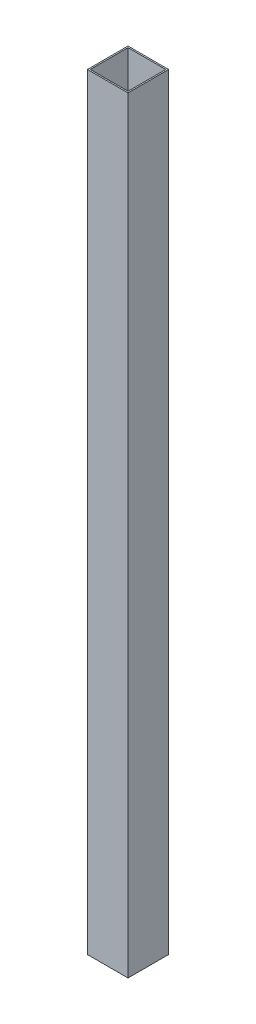
ISO-10303-21;
HEADER;
FILE_DESCRIPTION(('STEP AP214'),'2;1');
FILE_NAME('part.step','',(''),(''),'','','');
FILE_SCHEMA(('AUTOMOTIVE_DESIGN { 1 0 10303 214 1 1 1 1 }'));
ENDSEC;
DATA;
#1=APPLICATION_CONTEXT('core data for automotive mechanical design processes');
#2=APPLICATION_PROTOCOL_DEFINITION('international standard','automotive_design',2000,#1);
#3=PRODUCT_CONTEXT('',#1,'mechanical');
#4=PRODUCT('Part','Part','',(#3));
#5=PRODUCT_RELATED_PRODUCT_CATEGORY('part','',(#4));
#6=PRODUCT_DEFINITION_FORMATION('','',#4);
#7=PRODUCT_DEFINITION_CONTEXT('part definition',#1,'design');
#8=PRODUCT_DEFINITION('design','',#6,#7);
#9=PRODUCT_DEFINITION_SHAPE('','',#8);
#10=(LENGTH_UNIT() NAMED_UNIT(*) SI_UNIT(.MILLI.,.METRE.));
#11=(NAMED_UNIT(*) PLANE_ANGLE_UNIT() SI_UNIT($,.RADIAN.));
#12=(NAMED_UNIT(*) SI_UNIT($,.STERADIAN.) SOLID_ANGLE_UNIT());
#13=UNCERTAINTY_MEASURE_WITH_UNIT(LENGTH_MEASURE(1.E-05),#10,'distance_accuracy_value','');
#14=(GEOMETRIC_REPRESENTATION_CONTEXT(3) GLOBAL_UNCERTAINTY_ASSIGNED_CONTEXT((#13)) GLOBAL_UNIT_ASSIGNED_CONTEXT((#10,
#11,#12)) REPRESENTATION_CONTEXT('',''));
#15=CARTESIAN_POINT('',(0.,0.,0.));
#16=DIRECTION('',(0.,0.,1.));
#17=DIRECTION('',(1.,0.,0.));
#18=AXIS2_PLACEMENT_3D('',#15,#16,#17);
#19=CARTESIAN_POINT('',(0.,479.425,0.));
#20=DIRECTION('',(0.,1.,0.));
#21=DIRECTION('',(0.,0.,1.));
#22=AXIS2_PLACEMENT_3D('',#19,#20,#21);
#23=PLANE('',#22);
#24=DIRECTION('',(0.,0.,-1.));
#25=VECTOR('',#24,1.);
#26=CARTESIAN_POINT('',(12.7,479.425,-12.7));
#27=LINE('',#26,#25);
#28=CARTESIAN_POINT('',(12.7,479.425,12.7));
#29=VERTEX_POINT('',#28);
#30=CARTESIAN_POINT('',(12.7,479.425,-12.7));
#31=VERTEX_POINT('',#30);
#32=EDGE_CURVE('E136',#29,#31,#27,.T.);
#33=ORIENTED_EDGE('',*,*,#32,.T.);
#34=DIRECTION('',(-1.,0.,0.));
#35=VECTOR('',#34,1.);
#36=CARTESIAN_POINT('',(-12.7,479.425,-12.7));
#37=LINE('',#36,#35);
#38=CARTESIAN_POINT('',(-12.7,479.425,-12.7));
#39=VERTEX_POINT('',#38);
#40=EDGE_CURVE('E139',#31,#39,#37,.T.);
#41=ORIENTED_EDGE('',*,*,#40,.T.);
#42=DIRECTION('',(0.,0.,1.));
#43=VECTOR('',#42,1.);
#44=CARTESIAN_POINT('',(-12.7,479.425,-12.7));
#45=LINE('',#44,#43);
#46=CARTESIAN_POINT('',(-12.7,479.425,12.7));
#47=VERTEX_POINT('',#46);
#48=EDGE_CURVE('E142',#39,#47,#45,.T.);
#49=ORIENTED_EDGE('',*,*,#48,.T.);
#50=DIRECTION('',(1.,0.,0.));
#51=VECTOR('',#50,1.);
#52=CARTESIAN_POINT('',(-12.7,479.425,12.7));
#53=LINE('',#52,#51);
#54=EDGE_CURVE('E144',#47,#29,#53,.T.);
#55=ORIENTED_EDGE('',*,*,#54,.T.);
#56=EDGE_LOOP('',(#33,#41,#49,#55));
#57=FACE_BOUND('',#56,.T.);
#58=DIRECTION('',(1.,0.,0.));
#59=VECTOR('',#58,1.);
#60=CARTESIAN_POINT('',(-11.811,479.425,11.811));
#61=LINE('',#60,#59);
#62=CARTESIAN_POINT('',(-11.811,479.425,11.811));
#63=VERTEX_POINT('',#62);
#64=CARTESIAN_POINT('',(11.811,479.425,11.811));
#65=VERTEX_POINT('',#64);
#66=EDGE_CURVE('E108',#63,#65,#61,.T.);
#67=ORIENTED_EDGE('',*,*,#66,.F.);
#68=DIRECTION('',(0.,0.,1.));
#69=VECTOR('',#68,1.);
#70=CARTESIAN_POINT('',(-11.811,479.425,-11.811));
#71=LINE('',#70,#69);
#72=CARTESIAN_POINT('',(-11.811,479.425,-11.811));
#73=VERTEX_POINT('',#72);
#74=EDGE_CURVE('E100',#73,#63,#71,.T.);
#75=ORIENTED_EDGE('',*,*,#74,.F.);
#76=DIRECTION('',(-1.,0.,0.));
#77=VECTOR('',#76,1.);
#78=CARTESIAN_POINT('',(-11.811,479.425,-11.811));
#79=LINE('',#78,#77);
#80=CARTESIAN_POINT('',(11.811,479.425,-11.811));
#81=VERTEX_POINT('',#80);
#82=EDGE_CURVE('E122',#81,#73,#79,.T.);
#83=ORIENTED_EDGE('',*,*,#82,.F.);
#84=DIRECTION('',(0.,0.,-1.));
#85=VECTOR('',#84,1.);
#86=CARTESIAN_POINT('',(11.811,479.425,-11.811));
#87=LINE('',#86,#85);
#88=EDGE_CURVE('E120',#65,#81,#87,.T.);
#89=ORIENTED_EDGE('',*,*,#88,.F.);
#90=EDGE_LOOP('',(#67,#75,#83,#89));
#91=FACE_BOUND('',#90,.T.);
#92=ADVANCED_FACE('F35',(#57,#91),#23,.T.);
#93=CARTESIAN_POINT('',(0.,0.,0.));
#94=DIRECTION('',(0.,1.,0.));
#95=DIRECTION('',(0.,0.,1.));
#96=AXIS2_PLACEMENT_3D('',#93,#94,#95);
#97=PLANE('',#96);
#98=DIRECTION('',(0.,0.,-1.));
#99=VECTOR('',#98,1.);
#100=CARTESIAN_POINT('',(12.7,0.,-12.7));
#101=LINE('',#100,#99);
#102=CARTESIAN_POINT('',(12.7,0.,12.7));
#103=VERTEX_POINT('',#102);
#104=CARTESIAN_POINT('',(12.7,0.,-12.7));
#105=VERTEX_POINT('',#104);
#106=EDGE_CURVE('E116',#103,#105,#101,.T.);
#107=ORIENTED_EDGE('',*,*,#106,.F.);
#108=DIRECTION('',(1.,0.,0.));
#109=VECTOR('',#108,1.);
#110=CARTESIAN_POINT('',(-12.7,0.,12.7));
#111=LINE('',#110,#109);
#112=CARTESIAN_POINT('',(-12.7,0.,12.7));
#113=VERTEX_POINT('',#112);
#114=EDGE_CURVE('E140',#113,#103,#111,.T.);
#115=ORIENTED_EDGE('',*,*,#114,.F.);
#116=DIRECTION('',(0.,0.,1.));
#117=VECTOR('',#116,1.);
#118=CARTESIAN_POINT('',(-12.7,0.,-12.7));
#119=LINE('',#118,#117);
#120=CARTESIAN_POINT('',(-12.7,0.,-12.7));
#121=VERTEX_POINT('',#120);
#122=EDGE_CURVE('E151',#121,#113,#119,.T.);
#123=ORIENTED_EDGE('',*,*,#122,.F.);
#124=DIRECTION('',(-1.,0.,0.));
#125=VECTOR('',#124,1.);
#126=CARTESIAN_POINT('',(-12.7,0.,-12.7));
#127=LINE('',#126,#125);
#128=EDGE_CURVE('E149',#105,#121,#127,.T.);
#129=ORIENTED_EDGE('',*,*,#128,.F.);
#130=EDGE_LOOP('',(#107,#115,#123,#129));
#131=FACE_BOUND('',#130,.T.);
#132=DIRECTION('',(0.,0.,1.));
#133=VECTOR('',#132,1.);
#134=CARTESIAN_POINT('',(-11.811,0.,-11.811));
#135=LINE('',#134,#133);
#136=CARTESIAN_POINT('',(-11.811,0.,-11.811));
#137=VERTEX_POINT('',#136);
#138=CARTESIAN_POINT('',(-11.811,0.,11.811));
#139=VERTEX_POINT('',#138);
#140=EDGE_CURVE('E58',#137,#139,#135,.T.);
#141=ORIENTED_EDGE('',*,*,#140,.T.);
#142=DIRECTION('',(1.,0.,0.));
#143=VECTOR('',#142,1.);
#144=CARTESIAN_POINT('',(-11.811,0.,11.811));
#145=LINE('',#144,#143);
#146=CARTESIAN_POINT('',(11.811,0.,11.811));
#147=VERTEX_POINT('',#146);
#148=EDGE_CURVE('E115',#139,#147,#145,.T.);
#149=ORIENTED_EDGE('',*,*,#148,.T.);
#150=DIRECTION('',(0.,0.,-1.));
#151=VECTOR('',#150,1.);
#152=CARTESIAN_POINT('',(11.811,0.,-11.811));
#153=LINE('',#152,#151);
#154=CARTESIAN_POINT('',(11.811,0.,-11.811));
#155=VERTEX_POINT('',#154);
#156=EDGE_CURVE('E128',#147,#155,#153,.T.);
#157=ORIENTED_EDGE('',*,*,#156,.T.);
#158=DIRECTION('',(-1.,0.,0.));
#159=VECTOR('',#158,1.);
#160=CARTESIAN_POINT('',(-11.811,0.,-11.811));
#161=LINE('',#160,#159);
#162=EDGE_CURVE('E109',#155,#137,#161,.T.);
#163=ORIENTED_EDGE('',*,*,#162,.T.);
#164=EDGE_LOOP('',(#141,#149,#157,#163));
#165=FACE_BOUND('',#164,.T.);
#166=ADVANCED_FACE('F169',(#131,#165),#97,.F.);
#167=CARTESIAN_POINT('',(12.7,479.425,-12.7));
#168=DIRECTION('',(-1.,0.,0.));
#169=DIRECTION('',(0.,0.,1.));
#170=AXIS2_PLACEMENT_3D('',#167,#168,#169);
#171=PLANE('',#170);
#172=ORIENTED_EDGE('',*,*,#106,.T.);
#173=DIRECTION('',(0.,-1.,0.));
#174=VECTOR('',#173,1.);
#175=CARTESIAN_POINT('',(12.7,479.425,-12.7));
#176=LINE('',#175,#174);
#177=EDGE_CURVE('E11',#31,#105,#176,.T.);
#178=ORIENTED_EDGE('',*,*,#177,.F.);
#179=ORIENTED_EDGE('',*,*,#32,.F.);
#180=DIRECTION('',(0.,-1.,0.));
#181=VECTOR('',#180,1.);
#182=CARTESIAN_POINT('',(12.7,479.425,12.7));
#183=LINE('',#182,#181);
#184=EDGE_CURVE('E146',#29,#103,#183,.T.);
#185=ORIENTED_EDGE('',*,*,#184,.T.);
#186=EDGE_LOOP('',(#172,#178,#179,#185));
#187=FACE_BOUND('',#186,.T.);
#188=ADVANCED_FACE('F37',(#187),#171,.F.);
#189=CARTESIAN_POINT('',(-12.7,479.425,-12.7));
#190=DIRECTION('',(0.,0.,1.));
#191=DIRECTION('',(1.,0.,0.));
#192=AXIS2_PLACEMENT_3D('',#189,#190,#191);
#193=PLANE('',#192);
#194=ORIENTED_EDGE('',*,*,#128,.T.);
#195=DIRECTION('',(0.,-1.,0.));
#196=VECTOR('',#195,1.);
#197=CARTESIAN_POINT('',(-12.7,479.425,-12.7));
#198=LINE('',#197,#196);
#199=EDGE_CURVE('E43',#39,#121,#198,.T.);
#200=ORIENTED_EDGE('',*,*,#199,.F.);
#201=ORIENTED_EDGE('',*,*,#40,.F.);
#202=ORIENTED_EDGE('',*,*,#177,.T.);
#203=EDGE_LOOP('',(#194,#200,#201,#202));
#204=FACE_BOUND('',#203,.T.);
#205=ADVANCED_FACE('F179',(#204),#193,.F.);
#206=CARTESIAN_POINT('',(-12.7,479.425,-12.7));
#207=DIRECTION('',(1.,0.,0.));
#208=DIRECTION('',(0.,0.,-1.));
#209=AXIS2_PLACEMENT_3D('',#206,#207,#208);
#210=PLANE('',#209);
#211=ORIENTED_EDGE('',*,*,#122,.T.);
#212=DIRECTION('',(0.,-1.,0.));
#213=VECTOR('',#212,1.);
#214=CARTESIAN_POINT('',(-12.7,479.425,12.7));
#215=LINE('',#214,#213);
#216=EDGE_CURVE('E156',#47,#113,#215,.T.);
#217=ORIENTED_EDGE('',*,*,#216,.F.);
#218=ORIENTED_EDGE('',*,*,#48,.F.);
#219=ORIENTED_EDGE('',*,*,#199,.T.);
#220=EDGE_LOOP('',(#211,#217,#218,#219));
#221=FACE_BOUND('',#220,.T.);
#222=ADVANCED_FACE('F163',(#221),#210,.F.);
#223=CARTESIAN_POINT('',(-12.7,479.425,12.7));
#224=DIRECTION('',(0.,0.,-1.));
#225=DIRECTION('',(-1.,0.,0.));
#226=AXIS2_PLACEMENT_3D('',#223,#224,#225);
#227=PLANE('',#226);
#228=ORIENTED_EDGE('',*,*,#114,.T.);
#229=ORIENTED_EDGE('',*,*,#184,.F.);
#230=ORIENTED_EDGE('',*,*,#54,.F.);
#231=ORIENTED_EDGE('',*,*,#216,.T.);
#232=EDGE_LOOP('',(#228,#229,#230,#231));
#233=FACE_BOUND('',#232,.T.);
#234=ADVANCED_FACE('F173',(#233),#227,.F.);
#235=CARTESIAN_POINT('',(-11.811,479.425,-11.811));
#236=DIRECTION('',(1.,0.,0.));
#237=DIRECTION('',(0.,0.,-1.));
#238=AXIS2_PLACEMENT_3D('',#235,#236,#237);
#239=PLANE('',#238);
#240=ORIENTED_EDGE('',*,*,#140,.F.);
#241=DIRECTION('',(0.,-1.,0.));
#242=VECTOR('',#241,1.);
#243=CARTESIAN_POINT('',(-11.811,479.425,-11.811));
#244=LINE('',#243,#242);
#245=EDGE_CURVE('E104',#73,#137,#244,.T.);
#246=ORIENTED_EDGE('',*,*,#245,.F.);
#247=ORIENTED_EDGE('',*,*,#74,.T.);
#248=DIRECTION('',(0.,-1.,0.));
#249=VECTOR('',#248,1.);
#250=CARTESIAN_POINT('',(-11.811,479.425,11.811));
#251=LINE('',#250,#249);
#252=EDGE_CURVE('E103',#63,#139,#251,.T.);
#253=ORIENTED_EDGE('',*,*,#252,.T.);
#254=EDGE_LOOP('',(#240,#246,#247,#253));
#255=FACE_BOUND('',#254,.T.);
#256=ADVANCED_FACE('F102',(#255),#239,.T.);
#257=CARTESIAN_POINT('',(-11.811,479.425,11.811));
#258=DIRECTION('',(0.,0.,-1.));
#259=DIRECTION('',(-1.,0.,0.));
#260=AXIS2_PLACEMENT_3D('',#257,#258,#259);
#261=PLANE('',#260);
#262=ORIENTED_EDGE('',*,*,#148,.F.);
#263=ORIENTED_EDGE('',*,*,#252,.F.);
#264=ORIENTED_EDGE('',*,*,#66,.T.);
#265=DIRECTION('',(0.,-1.,0.));
#266=VECTOR('',#265,1.);
#267=CARTESIAN_POINT('',(11.811,479.425,11.811));
#268=LINE('',#267,#266);
#269=EDGE_CURVE('E117',#65,#147,#268,.T.);
#270=ORIENTED_EDGE('',*,*,#269,.T.);
#271=EDGE_LOOP('',(#262,#263,#264,#270));
#272=FACE_BOUND('',#271,.T.);
#273=ADVANCED_FACE('F112',(#272),#261,.T.);
#274=CARTESIAN_POINT('',(11.811,479.425,-11.811));
#275=DIRECTION('',(-1.,0.,0.));
#276=DIRECTION('',(0.,0.,1.));
#277=AXIS2_PLACEMENT_3D('',#274,#275,#276);
#278=PLANE('',#277);
#279=ORIENTED_EDGE('',*,*,#156,.F.);
#280=ORIENTED_EDGE('',*,*,#269,.F.);
#281=ORIENTED_EDGE('',*,*,#88,.T.);
#282=DIRECTION('',(0.,-1.,0.));
#283=VECTOR('',#282,1.);
#284=CARTESIAN_POINT('',(11.811,479.425,-11.811));
#285=LINE('',#284,#283);
#286=EDGE_CURVE('E50',#81,#155,#285,.T.);
#287=ORIENTED_EDGE('',*,*,#286,.T.);
#288=EDGE_LOOP('',(#279,#280,#281,#287));
#289=FACE_BOUND('',#288,.T.);
#290=ADVANCED_FACE('F202',(#289),#278,.T.);
#291=CARTESIAN_POINT('',(-11.811,479.425,-11.811));
#292=DIRECTION('',(0.,0.,1.));
#293=DIRECTION('',(1.,0.,0.));
#294=AXIS2_PLACEMENT_3D('',#291,#292,#293);
#295=PLANE('',#294);
#296=ORIENTED_EDGE('',*,*,#162,.F.);
#297=ORIENTED_EDGE('',*,*,#286,.F.);
#298=ORIENTED_EDGE('',*,*,#82,.T.);
#299=ORIENTED_EDGE('',*,*,#245,.T.);
#300=EDGE_LOOP('',(#296,#297,#298,#299));
#301=FACE_BOUND('',#300,.T.);
#302=ADVANCED_FACE('F206',(#301),#295,.T.);
#303=CLOSED_SHELL('',(#92,#166,#188,#205,#222,#234,#256,#273,#290,#302));
#304=MANIFOLD_SOLID_BREP('B2',#303);
#305=ADVANCED_BREP_SHAPE_REPRESENTATION('',(#18,#304),#14);
#306=SHAPE_DEFINITION_REPRESENTATION(#9,#305);
ENDSEC;
END-ISO-10303-21;
